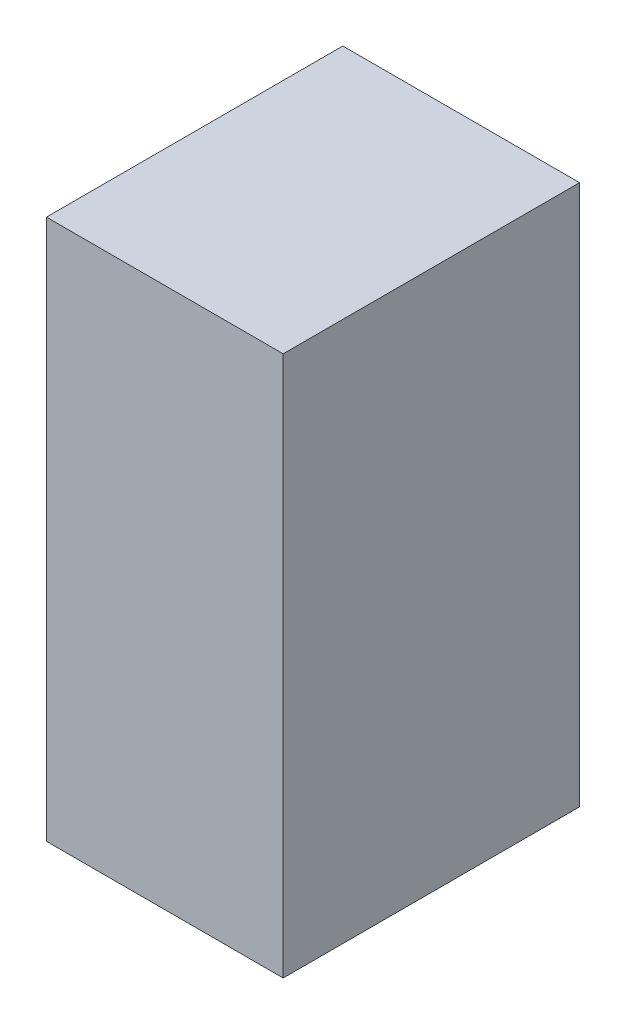
ISO-10303-21;
HEADER;
FILE_DESCRIPTION(('STEP AP214'),'2;1');
FILE_NAME('part.step','',(''),(''),'','','');
FILE_SCHEMA(('AUTOMOTIVE_DESIGN { 1 0 10303 214 1 1 1 1 }'));
ENDSEC;
DATA;
#1=APPLICATION_CONTEXT('core data for automotive mechanical design processes');
#2=APPLICATION_PROTOCOL_DEFINITION('international standard','automotive_design',2000,#1);
#3=PRODUCT_CONTEXT('',#1,'mechanical');
#4=PRODUCT('Part','Part','',(#3));
#5=PRODUCT_RELATED_PRODUCT_CATEGORY('part','',(#4));
#6=PRODUCT_DEFINITION_FORMATION('','',#4);
#7=PRODUCT_DEFINITION_CONTEXT('part definition',#1,'design');
#8=PRODUCT_DEFINITION('design','',#6,#7);
#9=PRODUCT_DEFINITION_SHAPE('','',#8);
#10=(LENGTH_UNIT() NAMED_UNIT(*) SI_UNIT(.MILLI.,.METRE.));
#11=(NAMED_UNIT(*) PLANE_ANGLE_UNIT() SI_UNIT($,.RADIAN.));
#12=(NAMED_UNIT(*) SI_UNIT($,.STERADIAN.) SOLID_ANGLE_UNIT());
#13=UNCERTAINTY_MEASURE_WITH_UNIT(LENGTH_MEASURE(1.E-05),#10,'distance_accuracy_value','');
#14=(GEOMETRIC_REPRESENTATION_CONTEXT(3) GLOBAL_UNCERTAINTY_ASSIGNED_CONTEXT((#13)) GLOBAL_UNIT_ASSIGNED_CONTEXT((#10,
#11,#12)) REPRESENTATION_CONTEXT('',''));
#15=CARTESIAN_POINT('',(0.,0.,0.));
#16=DIRECTION('',(0.,0.,1.));
#17=DIRECTION('',(1.,0.,0.));
#18=AXIS2_PLACEMENT_3D('',#15,#16,#17);
#19=CARTESIAN_POINT('',(12.7,58.,-15.9));
#20=DIRECTION('',(-1.,0.,0.));
#21=DIRECTION('',(0.,0.,1.));
#22=AXIS2_PLACEMENT_3D('',#19,#20,#21);
#23=PLANE('',#22);
#24=DIRECTION('',(0.,0.,-1.));
#25=VECTOR('',#24,1.);
#26=CARTESIAN_POINT('',(12.7,0.,-15.9));
#27=LINE('',#26,#25);
#28=CARTESIAN_POINT('',(12.7,0.,15.9));
#29=VERTEX_POINT('',#28);
#30=CARTESIAN_POINT('',(12.7,0.,-15.9));
#31=VERTEX_POINT('',#30);
#32=EDGE_CURVE('E107',#29,#31,#27,.T.);
#33=ORIENTED_EDGE('',*,*,#32,.T.);
#34=DIRECTION('',(0.,-1.,0.));
#35=VECTOR('',#34,1.);
#36=CARTESIAN_POINT('',(12.7,58.,-15.9));
#37=LINE('',#36,#35);
#38=CARTESIAN_POINT('',(12.7,58.,-15.9));
#39=VERTEX_POINT('',#38);
#40=EDGE_CURVE('E11',#39,#31,#37,.T.);
#41=ORIENTED_EDGE('',*,*,#40,.F.);
#42=DIRECTION('',(0.,0.,-1.));
#43=VECTOR('',#42,1.);
#44=CARTESIAN_POINT('',(12.7,58.,-15.9));
#45=LINE('',#44,#43);
#46=CARTESIAN_POINT('',(12.7,58.,15.9));
#47=VERTEX_POINT('',#46);
#48=EDGE_CURVE('E91',#47,#39,#45,.T.);
#49=ORIENTED_EDGE('',*,*,#48,.F.);
#50=DIRECTION('',(0.,-1.,0.));
#51=VECTOR('',#50,1.);
#52=CARTESIAN_POINT('',(12.7,58.,15.9));
#53=LINE('',#52,#51);
#54=EDGE_CURVE('E103',#47,#29,#53,.T.);
#55=ORIENTED_EDGE('',*,*,#54,.T.);
#56=EDGE_LOOP('',(#33,#41,#49,#55));
#57=FACE_BOUND('',#56,.T.);
#58=ADVANCED_FACE('F39',(#57),#23,.F.);
#59=CARTESIAN_POINT('',(-12.7,58.,-15.9));
#60=DIRECTION('',(0.,0.,1.));
#61=DIRECTION('',(1.,0.,0.));
#62=AXIS2_PLACEMENT_3D('',#59,#60,#61);
#63=PLANE('',#62);
#64=DIRECTION('',(-1.,0.,0.));
#65=VECTOR('',#64,1.);
#66=CARTESIAN_POINT('',(-12.7,0.,-15.9));
#67=LINE('',#66,#65);
#68=CARTESIAN_POINT('',(-12.7,0.,-15.9));
#69=VERTEX_POINT('',#68);
#70=EDGE_CURVE('E96',#31,#69,#67,.T.);
#71=ORIENTED_EDGE('',*,*,#70,.T.);
#72=DIRECTION('',(0.,-1.,0.));
#73=VECTOR('',#72,1.);
#74=CARTESIAN_POINT('',(-12.7,58.,-15.9));
#75=LINE('',#74,#73);
#76=CARTESIAN_POINT('',(-12.7,58.,-15.9));
#77=VERTEX_POINT('',#76);
#78=EDGE_CURVE('E48',#77,#69,#75,.T.);
#79=ORIENTED_EDGE('',*,*,#78,.F.);
#80=DIRECTION('',(-1.,0.,0.));
#81=VECTOR('',#80,1.);
#82=CARTESIAN_POINT('',(-12.7,58.,-15.9));
#83=LINE('',#82,#81);
#84=EDGE_CURVE('E86',#39,#77,#83,.T.);
#85=ORIENTED_EDGE('',*,*,#84,.F.);
#86=ORIENTED_EDGE('',*,*,#40,.T.);
#87=EDGE_LOOP('',(#71,#79,#85,#86));
#88=FACE_BOUND('',#87,.T.);
#89=ADVANCED_FACE('F95',(#88),#63,.F.);
#90=CARTESIAN_POINT('',(-12.7,58.,-15.9));
#91=DIRECTION('',(1.,0.,0.));
#92=DIRECTION('',(0.,0.,-1.));
#93=AXIS2_PLACEMENT_3D('',#90,#91,#92);
#94=PLANE('',#93);
#95=DIRECTION('',(0.,0.,1.));
#96=VECTOR('',#95,1.);
#97=CARTESIAN_POINT('',(-12.7,0.,-15.9));
#98=LINE('',#97,#96);
#99=CARTESIAN_POINT('',(-12.7,0.,15.9));
#100=VERTEX_POINT('',#99);
#101=EDGE_CURVE('E73',#69,#100,#98,.T.);
#102=ORIENTED_EDGE('',*,*,#101,.T.);
#103=DIRECTION('',(0.,-1.,0.));
#104=VECTOR('',#103,1.);
#105=CARTESIAN_POINT('',(-12.7,58.,15.9));
#106=LINE('',#105,#104);
#107=CARTESIAN_POINT('',(-12.7,58.,15.9));
#108=VERTEX_POINT('',#107);
#109=EDGE_CURVE('E98',#108,#100,#106,.T.);
#110=ORIENTED_EDGE('',*,*,#109,.F.);
#111=DIRECTION('',(0.,0.,1.));
#112=VECTOR('',#111,1.);
#113=CARTESIAN_POINT('',(-12.7,58.,-15.9));
#114=LINE('',#113,#112);
#115=EDGE_CURVE('E89',#77,#108,#114,.T.);
#116=ORIENTED_EDGE('',*,*,#115,.F.);
#117=ORIENTED_EDGE('',*,*,#78,.T.);
#118=EDGE_LOOP('',(#102,#110,#116,#117));
#119=FACE_BOUND('',#118,.T.);
#120=ADVANCED_FACE('F99',(#119),#94,.F.);
#121=CARTESIAN_POINT('',(-12.7,58.,15.9));
#122=DIRECTION('',(0.,0.,-1.));
#123=DIRECTION('',(-1.,0.,0.));
#124=AXIS2_PLACEMENT_3D('',#121,#122,#123);
#125=PLANE('',#124);
#126=DIRECTION('',(1.,0.,0.));
#127=VECTOR('',#126,1.);
#128=CARTESIAN_POINT('',(-12.7,0.,15.9));
#129=LINE('',#128,#127);
#130=EDGE_CURVE('E79',#100,#29,#129,.T.);
#131=ORIENTED_EDGE('',*,*,#130,.T.);
#132=ORIENTED_EDGE('',*,*,#54,.F.);
#133=DIRECTION('',(1.,0.,0.));
#134=VECTOR('',#133,1.);
#135=CARTESIAN_POINT('',(-12.7,58.,15.9));
#136=LINE('',#135,#134);
#137=EDGE_CURVE('E56',#108,#47,#136,.T.);
#138=ORIENTED_EDGE('',*,*,#137,.F.);
#139=ORIENTED_EDGE('',*,*,#109,.T.);
#140=EDGE_LOOP('',(#131,#132,#138,#139));
#141=FACE_BOUND('',#140,.T.);
#142=ADVANCED_FACE('F120',(#141),#125,.F.);
#143=CARTESIAN_POINT('',(0.,58.,0.));
#144=DIRECTION('',(0.,1.,0.));
#145=DIRECTION('',(0.,0.,1.));
#146=AXIS2_PLACEMENT_3D('',#143,#144,#145);
#147=PLANE('',#146);
#148=ORIENTED_EDGE('',*,*,#48,.T.);
#149=ORIENTED_EDGE('',*,*,#84,.T.);
#150=ORIENTED_EDGE('',*,*,#115,.T.);
#151=ORIENTED_EDGE('',*,*,#137,.T.);
#152=EDGE_LOOP('',(#148,#149,#150,#151));
#153=FACE_BOUND('',#152,.T.);
#154=ADVANCED_FACE('F87',(#153),#147,.T.);
#155=CARTESIAN_POINT('',(0.,0.,0.));
#156=DIRECTION('',(0.,1.,0.));
#157=DIRECTION('',(0.,0.,1.));
#158=AXIS2_PLACEMENT_3D('',#155,#156,#157);
#159=PLANE('',#158);
#160=ORIENTED_EDGE('',*,*,#32,.F.);
#161=ORIENTED_EDGE('',*,*,#130,.F.);
#162=ORIENTED_EDGE('',*,*,#101,.F.);
#163=ORIENTED_EDGE('',*,*,#70,.F.);
#164=EDGE_LOOP('',(#160,#161,#162,#163));
#165=FACE_BOUND('',#164,.T.);
#166=ADVANCED_FACE('F123',(#165),#159,.F.);
#167=CLOSED_SHELL('',(#58,#89,#120,#142,#154,#166));
#168=MANIFOLD_SOLID_BREP('B2',#167);
#169=ADVANCED_BREP_SHAPE_REPRESENTATION('',(#18,#168),#14);
#170=SHAPE_DEFINITION_REPRESENTATION(#9,#169);
ENDSEC;
END-ISO-10303-21;
